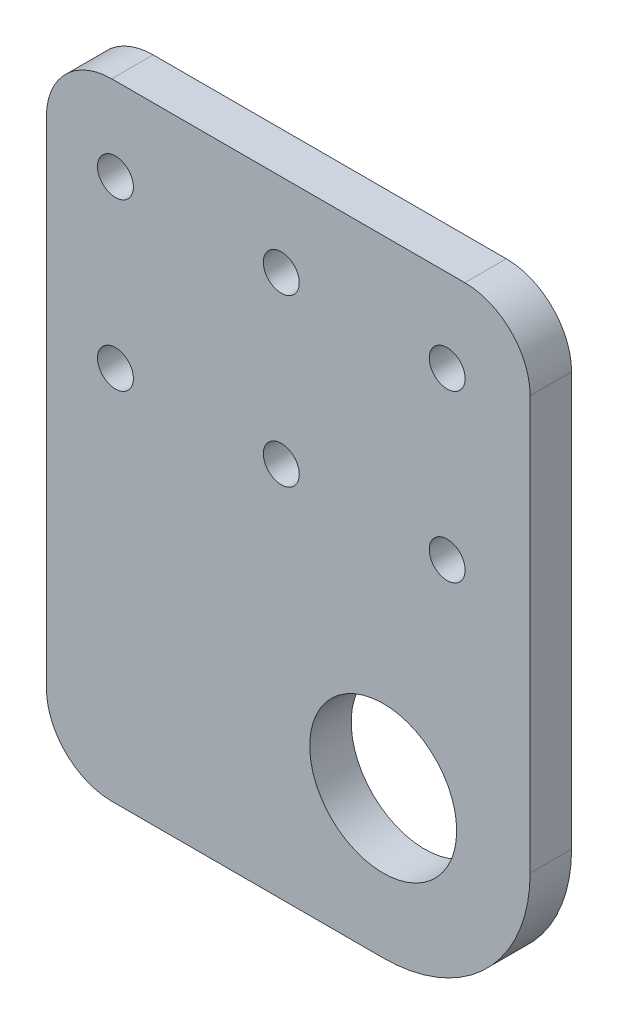
ISO-10303-21;
HEADER;
FILE_DESCRIPTION(('STEP AP214'),'2;1');
FILE_NAME('part.step','',(''),(''),'','','');
FILE_SCHEMA(('AUTOMOTIVE_DESIGN { 1 0 10303 214 1 1 1 1 }'));
ENDSEC;
DATA;
#1=APPLICATION_CONTEXT('core data for automotive mechanical design processes');
#2=APPLICATION_PROTOCOL_DEFINITION('international standard','automotive_design',2000,#1);
#3=PRODUCT_CONTEXT('',#1,'mechanical');
#4=PRODUCT('Part','Part','',(#3));
#5=PRODUCT_RELATED_PRODUCT_CATEGORY('part','',(#4));
#6=PRODUCT_DEFINITION_FORMATION('','',#4);
#7=PRODUCT_DEFINITION_CONTEXT('part definition',#1,'design');
#8=PRODUCT_DEFINITION('design','',#6,#7);
#9=PRODUCT_DEFINITION_SHAPE('','',#8);
#10=(LENGTH_UNIT() NAMED_UNIT(*) SI_UNIT(.MILLI.,.METRE.));
#11=(NAMED_UNIT(*) PLANE_ANGLE_UNIT() SI_UNIT($,.RADIAN.));
#12=(NAMED_UNIT(*) SI_UNIT($,.STERADIAN.) SOLID_ANGLE_UNIT());
#13=UNCERTAINTY_MEASURE_WITH_UNIT(LENGTH_MEASURE(1.E-05),#10,'distance_accuracy_value','');
#14=(GEOMETRIC_REPRESENTATION_CONTEXT(3) GLOBAL_UNCERTAINTY_ASSIGNED_CONTEXT((#13)) GLOBAL_UNIT_ASSIGNED_CONTEXT((#10,
#11,#12)) REPRESENTATION_CONTEXT('',''));
#15=CARTESIAN_POINT('',(0.,0.,0.));
#16=DIRECTION('',(0.,0.,1.));
#17=DIRECTION('',(1.,0.,0.));
#18=AXIS2_PLACEMENT_3D('',#15,#16,#17);
#19=CARTESIAN_POINT('',(-37.035,-25.4,6.35));
#20=DIRECTION('',(1.,0.,0.));
#21=DIRECTION('',(0.,1.,0.));
#22=AXIS2_PLACEMENT_3D('',#19,#20,#21);
#23=PLANE('',#22);
#24=DIRECTION('',(0.,-1.,0.));
#25=VECTOR('',#24,1.);
#26=CARTESIAN_POINT('',(-37.035,-25.4,0.));
#27=LINE('',#26,#25);
#28=CARTESIAN_POINT('',(-37.035,15.4,0.));
#29=VERTEX_POINT('',#28);
#30=CARTESIAN_POINT('',(-37.035,-60.4,0.));
#31=VERTEX_POINT('',#30);
#32=EDGE_CURVE('E115',#29,#31,#27,.T.);
#33=ORIENTED_EDGE('',*,*,#32,.T.);
#34=DIRECTION('',(0.,0.,1.));
#35=VECTOR('',#34,1.);
#36=CARTESIAN_POINT('',(-37.035,-60.4,6.35));
#37=LINE('',#36,#35);
#38=CARTESIAN_POINT('',(-37.035,-60.4,6.35));
#39=VERTEX_POINT('',#38);
#40=EDGE_CURVE('E150',#31,#39,#37,.T.);
#41=ORIENTED_EDGE('',*,*,#40,.T.);
#42=DIRECTION('',(0.,-1.,0.));
#43=VECTOR('',#42,1.);
#44=CARTESIAN_POINT('',(-37.035,-25.4,6.35));
#45=LINE('',#44,#43);
#46=CARTESIAN_POINT('',(-37.035,15.4,6.35));
#47=VERTEX_POINT('',#46);
#48=EDGE_CURVE('E118',#47,#39,#45,.T.);
#49=ORIENTED_EDGE('',*,*,#48,.F.);
#50=DIRECTION('',(0.,0.,-1.));
#51=VECTOR('',#50,1.);
#52=CARTESIAN_POINT('',(-37.035,15.4,6.35));
#53=LINE('',#52,#51);
#54=EDGE_CURVE('E102',#47,#29,#53,.T.);
#55=ORIENTED_EDGE('',*,*,#54,.T.);
#56=EDGE_LOOP('',(#33,#41,#49,#55));
#57=FACE_BOUND('',#56,.T.);
#58=ADVANCED_FACE('F35',(#57),#23,.F.);
#59=CARTESIAN_POINT('',(37.035,-25.4,6.35));
#60=DIRECTION('',(-1.,0.,0.));
#61=DIRECTION('',(0.,-1.,0.));
#62=AXIS2_PLACEMENT_3D('',#59,#60,#61);
#63=PLANE('',#62);
#64=DIRECTION('',(0.,1.,0.));
#65=VECTOR('',#64,1.);
#66=CARTESIAN_POINT('',(37.035,-25.4,6.35));
#67=LINE('',#66,#65);
#68=CARTESIAN_POINT('',(37.035,-47.9,6.35));
#69=VERTEX_POINT('',#68);
#70=CARTESIAN_POINT('',(37.035,15.4,6.35));
#71=VERTEX_POINT('',#70);
#72=EDGE_CURVE('E212',#69,#71,#67,.T.);
#73=ORIENTED_EDGE('',*,*,#72,.F.);
#74=DIRECTION('',(0.,0.,1.));
#75=VECTOR('',#74,1.);
#76=CARTESIAN_POINT('',(37.035,-47.9,0.));
#77=LINE('',#76,#75);
#78=CARTESIAN_POINT('',(37.035,-47.9,0.));
#79=VERTEX_POINT('',#78);
#80=EDGE_CURVE('E43',#69,#79,#77,.F.);
#81=ORIENTED_EDGE('',*,*,#80,.T.);
#82=DIRECTION('',(0.,1.,0.));
#83=VECTOR('',#82,1.);
#84=CARTESIAN_POINT('',(37.035,-25.4,0.));
#85=LINE('',#84,#83);
#86=CARTESIAN_POINT('',(37.035,15.4,0.));
#87=VERTEX_POINT('',#86);
#88=EDGE_CURVE('E126',#79,#87,#85,.T.);
#89=ORIENTED_EDGE('',*,*,#88,.T.);
#90=DIRECTION('',(0.,0.,-1.));
#91=VECTOR('',#90,1.);
#92=CARTESIAN_POINT('',(37.035,15.4,6.35));
#93=LINE('',#92,#91);
#94=EDGE_CURVE('E143',#87,#71,#93,.F.);
#95=ORIENTED_EDGE('',*,*,#94,.T.);
#96=EDGE_LOOP('',(#73,#81,#89,#95));
#97=FACE_BOUND('',#96,.T.);
#98=ADVANCED_FACE('F230',(#97),#63,.F.);
#99=CARTESIAN_POINT('',(37.035,25.4,6.35));
#100=DIRECTION('',(0.,-1.,0.));
#101=DIRECTION('',(1.,0.,0.));
#102=AXIS2_PLACEMENT_3D('',#99,#100,#101);
#103=PLANE('',#102);
#104=DIRECTION('',(-1.,0.,0.));
#105=VECTOR('',#104,1.);
#106=CARTESIAN_POINT('',(37.035,25.4,6.35));
#107=LINE('',#106,#105);
#108=CARTESIAN_POINT('',(27.035,25.4,6.35));
#109=VERTEX_POINT('',#108);
#110=CARTESIAN_POINT('',(-27.035,25.4,6.35));
#111=VERTEX_POINT('',#110);
#112=EDGE_CURVE('E109',#109,#111,#107,.T.);
#113=ORIENTED_EDGE('',*,*,#112,.F.);
#114=DIRECTION('',(0.,0.,-1.));
#115=VECTOR('',#114,1.);
#116=CARTESIAN_POINT('',(27.035,25.4,6.35));
#117=LINE('',#116,#115);
#118=CARTESIAN_POINT('',(27.035,25.4,0.));
#119=VERTEX_POINT('',#118);
#120=EDGE_CURVE('E147',#109,#119,#117,.T.);
#121=ORIENTED_EDGE('',*,*,#120,.T.);
#122=DIRECTION('',(-1.,0.,0.));
#123=VECTOR('',#122,1.);
#124=CARTESIAN_POINT('',(37.035,25.4,0.));
#125=LINE('',#124,#123);
#126=CARTESIAN_POINT('',(-27.035,25.4,0.));
#127=VERTEX_POINT('',#126);
#128=EDGE_CURVE('E129',#119,#127,#125,.T.);
#129=ORIENTED_EDGE('',*,*,#128,.T.);
#130=DIRECTION('',(0.,0.,-1.));
#131=VECTOR('',#130,1.);
#132=CARTESIAN_POINT('',(-27.035,25.4,6.35));
#133=LINE('',#132,#131);
#134=EDGE_CURVE('E103',#127,#111,#133,.F.);
#135=ORIENTED_EDGE('',*,*,#134,.T.);
#136=EDGE_LOOP('',(#113,#121,#129,#135));
#137=FACE_BOUND('',#136,.T.);
#138=ADVANCED_FACE('F218',(#137),#103,.F.);
#139=CARTESIAN_POINT('',(0.,0.,6.35));
#140=DIRECTION('',(0.,0.,1.));
#141=DIRECTION('',(1.,0.,0.));
#142=AXIS2_PLACEMENT_3D('',#139,#140,#141);
#143=PLANE('',#142);
#144=CARTESIAN_POINT('',(14.535,-47.9,6.35));
#145=DIRECTION('',(0.,0.,1.));
#146=DIRECTION('',(1.,0.,0.));
#147=AXIS2_PLACEMENT_3D('',#144,#145,#146);
#148=CIRCLE('',#147,11.25);
#149=CARTESIAN_POINT('',(25.785,-47.9,6.35));
#150=VERTEX_POINT('',#149);
#151=EDGE_CURVE('E177',#150,#150,#148,.T.);
#152=ORIENTED_EDGE('',*,*,#151,.F.);
#153=EDGE_LOOP('',(#152));
#154=FACE_BOUND('',#153,.T.);
#155=DIRECTION('',(1.,0.,0.));
#156=VECTOR('',#155,1.);
#157=CARTESIAN_POINT('',(37.035,-70.4,6.35));
#158=LINE('',#157,#156);
#159=CARTESIAN_POINT('',(-27.035,-70.4,6.35));
#160=VERTEX_POINT('',#159);
#161=CARTESIAN_POINT('',(14.535,-70.4,6.35));
#162=VERTEX_POINT('',#161);
#163=EDGE_CURVE('E165',#160,#162,#158,.T.);
#164=ORIENTED_EDGE('',*,*,#163,.T.);
#165=CARTESIAN_POINT('',(14.535,-47.9,6.35));
#166=DIRECTION('',(0.,0.,1.));
#167=DIRECTION('',(1.,0.,0.));
#168=AXIS2_PLACEMENT_3D('',#165,#166,#167);
#169=CIRCLE('',#168,22.5);
#170=EDGE_CURVE('E57',#162,#69,#169,.T.);
#171=ORIENTED_EDGE('',*,*,#170,.T.);
#172=ORIENTED_EDGE('',*,*,#72,.T.);
#173=CARTESIAN_POINT('',(27.035,15.4,6.35));
#174=DIRECTION('',(0.,0.,1.));
#175=DIRECTION('',(1.,0.,0.));
#176=AXIS2_PLACEMENT_3D('',#173,#174,#175);
#177=CIRCLE('',#176,10.);
#178=EDGE_CURVE('E141',#71,#109,#177,.T.);
#179=ORIENTED_EDGE('',*,*,#178,.T.);
#180=ORIENTED_EDGE('',*,*,#112,.T.);
#181=CARTESIAN_POINT('',(-27.035,15.4,6.35));
#182=DIRECTION('',(0.,0.,1.));
#183=DIRECTION('',(1.,0.,0.));
#184=AXIS2_PLACEMENT_3D('',#181,#182,#183);
#185=CIRCLE('',#184,10.);
#186=EDGE_CURVE('E119',#111,#47,#185,.T.);
#187=ORIENTED_EDGE('',*,*,#186,.T.);
#188=ORIENTED_EDGE('',*,*,#48,.T.);
#189=CARTESIAN_POINT('',(-27.035,-60.4,6.35));
#190=DIRECTION('',(0.,0.,1.));
#191=DIRECTION('',(1.,0.,0.));
#192=AXIS2_PLACEMENT_3D('',#189,#190,#191);
#193=CIRCLE('',#192,10.);
#194=EDGE_CURVE('E152',#39,#160,#193,.T.);
#195=ORIENTED_EDGE('',*,*,#194,.T.);
#196=EDGE_LOOP('',(#164,#171,#172,#179,#180,#187,#188,#195));
#197=FACE_BOUND('',#196,.T.);
#198=CARTESIAN_POINT('',(-26.465,12.7,6.35));
#199=DIRECTION('',(0.,0.,1.));
#200=DIRECTION('',(1.,0.,0.));
#201=AXIS2_PLACEMENT_3D('',#198,#199,#200);
#202=CIRCLE('',#201,2.74999999999999);
#203=CARTESIAN_POINT('',(-23.715,12.7,6.35));
#204=VERTEX_POINT('',#203);
#205=EDGE_CURVE('E174',#204,#204,#202,.T.);
#206=ORIENTED_EDGE('',*,*,#205,.F.);
#207=EDGE_LOOP('',(#206));
#208=FACE_BOUND('',#207,.T.);
#209=CARTESIAN_POINT('',(-26.465,-12.7,6.35));
#210=DIRECTION('',(0.,0.,1.));
#211=DIRECTION('',(1.,0.,0.));
#212=AXIS2_PLACEMENT_3D('',#209,#210,#211);
#213=CIRCLE('',#212,2.74999999999999);
#214=CARTESIAN_POINT('',(-23.715,-12.7,6.35));
#215=VERTEX_POINT('',#214);
#216=EDGE_CURVE('E186',#215,#215,#213,.T.);
#217=ORIENTED_EDGE('',*,*,#216,.F.);
#218=EDGE_LOOP('',(#217));
#219=FACE_BOUND('',#218,.T.);
#220=CARTESIAN_POINT('',(-1.06499999999997,-12.7,6.35));
#221=DIRECTION('',(0.,0.,1.));
#222=DIRECTION('',(1.,0.,0.));
#223=AXIS2_PLACEMENT_3D('',#220,#221,#222);
#224=CIRCLE('',#223,2.74999999999999);
#225=CARTESIAN_POINT('',(1.68500000000001,-12.7,6.35));
#226=VERTEX_POINT('',#225);
#227=EDGE_CURVE('E192',#226,#226,#224,.T.);
#228=ORIENTED_EDGE('',*,*,#227,.F.);
#229=EDGE_LOOP('',(#228));
#230=FACE_BOUND('',#229,.T.);
#231=CARTESIAN_POINT('',(-1.06499999999998,12.7,6.35));
#232=DIRECTION('',(0.,0.,1.));
#233=DIRECTION('',(1.,0.,0.));
#234=AXIS2_PLACEMENT_3D('',#231,#232,#233);
#235=CIRCLE('',#234,2.74999999999999);
#236=CARTESIAN_POINT('',(1.68500000000001,12.7,6.35));
#237=VERTEX_POINT('',#236);
#238=EDGE_CURVE('E198',#237,#237,#235,.T.);
#239=ORIENTED_EDGE('',*,*,#238,.F.);
#240=EDGE_LOOP('',(#239));
#241=FACE_BOUND('',#240,.T.);
#242=CARTESIAN_POINT('',(24.335,12.7,6.35));
#243=DIRECTION('',(0.,0.,1.));
#244=DIRECTION('',(1.,0.,0.));
#245=AXIS2_PLACEMENT_3D('',#242,#243,#244);
#246=CIRCLE('',#245,2.74999999999999);
#247=CARTESIAN_POINT('',(27.085,12.7,6.35));
#248=VERTEX_POINT('',#247);
#249=EDGE_CURVE('E204',#248,#248,#246,.T.);
#250=ORIENTED_EDGE('',*,*,#249,.F.);
#251=EDGE_LOOP('',(#250));
#252=FACE_BOUND('',#251,.T.);
#253=CARTESIAN_POINT('',(24.335,-12.7,6.35));
#254=DIRECTION('',(0.,0.,1.));
#255=DIRECTION('',(1.,0.,0.));
#256=AXIS2_PLACEMENT_3D('',#253,#254,#255);
#257=CIRCLE('',#256,2.74999999999999);
#258=CARTESIAN_POINT('',(27.085,-12.7,6.35));
#259=VERTEX_POINT('',#258);
#260=EDGE_CURVE('E132',#259,#259,#257,.T.);
#261=ORIENTED_EDGE('',*,*,#260,.F.);
#262=EDGE_LOOP('',(#261));
#263=FACE_BOUND('',#262,.T.);
#264=ADVANCED_FACE('F170',(#154,#197,#208,#219,#230,#241,#252,#263),#143,.T.);
#265=CARTESIAN_POINT('',(0.,0.,0.));
#266=DIRECTION('',(0.,0.,1.));
#267=DIRECTION('',(1.,0.,0.));
#268=AXIS2_PLACEMENT_3D('',#265,#266,#267);
#269=PLANE('',#268);
#270=CARTESIAN_POINT('',(14.535,-47.9,0.));
#271=DIRECTION('',(0.,0.,1.));
#272=DIRECTION('',(1.,0.,0.));
#273=AXIS2_PLACEMENT_3D('',#270,#271,#272);
#274=CIRCLE('',#273,11.25);
#275=CARTESIAN_POINT('',(25.785,-47.9,0.));
#276=VERTEX_POINT('',#275);
#277=EDGE_CURVE('E172',#276,#276,#274,.T.);
#278=ORIENTED_EDGE('',*,*,#277,.T.);
#279=EDGE_LOOP('',(#278));
#280=FACE_BOUND('',#279,.T.);
#281=ORIENTED_EDGE('',*,*,#88,.F.);
#282=CARTESIAN_POINT('',(14.535,-47.9,0.));
#283=DIRECTION('',(0.,0.,1.));
#284=DIRECTION('',(1.,0.,0.));
#285=AXIS2_PLACEMENT_3D('',#282,#283,#284);
#286=CIRCLE('',#285,22.5);
#287=CARTESIAN_POINT('',(14.535,-70.4,0.));
#288=VERTEX_POINT('',#287);
#289=EDGE_CURVE('E11',#79,#288,#286,.F.);
#290=ORIENTED_EDGE('',*,*,#289,.T.);
#291=DIRECTION('',(1.,0.,0.));
#292=VECTOR('',#291,1.);
#293=CARTESIAN_POINT('',(37.035,-70.4,0.));
#294=LINE('',#293,#292);
#295=CARTESIAN_POINT('',(-27.035,-70.4,0.));
#296=VERTEX_POINT('',#295);
#297=EDGE_CURVE('E167',#296,#288,#294,.T.);
#298=ORIENTED_EDGE('',*,*,#297,.F.);
#299=CARTESIAN_POINT('',(-27.035,-60.4,0.));
#300=DIRECTION('',(0.,0.,1.));
#301=DIRECTION('',(1.,0.,0.));
#302=AXIS2_PLACEMENT_3D('',#299,#300,#301);
#303=CIRCLE('',#302,10.);
#304=EDGE_CURVE('E125',#296,#31,#303,.F.);
#305=ORIENTED_EDGE('',*,*,#304,.T.);
#306=ORIENTED_EDGE('',*,*,#32,.F.);
#307=CARTESIAN_POINT('',(-27.035,15.4,0.));
#308=DIRECTION('',(0.,0.,1.));
#309=DIRECTION('',(1.,0.,0.));
#310=AXIS2_PLACEMENT_3D('',#307,#308,#309);
#311=CIRCLE('',#310,10.);
#312=EDGE_CURVE('E98',#29,#127,#311,.F.);
#313=ORIENTED_EDGE('',*,*,#312,.T.);
#314=ORIENTED_EDGE('',*,*,#128,.F.);
#315=CARTESIAN_POINT('',(27.035,15.4,0.));
#316=DIRECTION('',(0.,0.,1.));
#317=DIRECTION('',(1.,0.,0.));
#318=AXIS2_PLACEMENT_3D('',#315,#316,#317);
#319=CIRCLE('',#318,10.);
#320=EDGE_CURVE('E108',#119,#87,#319,.F.);
#321=ORIENTED_EDGE('',*,*,#320,.T.);
#322=EDGE_LOOP('',(#281,#290,#298,#305,#306,#313,#314,#321));
#323=FACE_BOUND('',#322,.T.);
#324=CARTESIAN_POINT('',(-26.465,12.7,0.));
#325=DIRECTION('',(0.,0.,1.));
#326=DIRECTION('',(1.,0.,0.));
#327=AXIS2_PLACEMENT_3D('',#324,#325,#326);
#328=CIRCLE('',#327,2.75);
#329=CARTESIAN_POINT('',(-23.715,12.7,0.));
#330=VERTEX_POINT('',#329);
#331=EDGE_CURVE('E183',#330,#330,#328,.T.);
#332=ORIENTED_EDGE('',*,*,#331,.T.);
#333=EDGE_LOOP('',(#332));
#334=FACE_BOUND('',#333,.T.);
#335=CARTESIAN_POINT('',(-26.465,-12.7,0.));
#336=DIRECTION('',(0.,0.,1.));
#337=DIRECTION('',(1.,0.,0.));
#338=AXIS2_PLACEMENT_3D('',#335,#336,#337);
#339=CIRCLE('',#338,2.75);
#340=CARTESIAN_POINT('',(-23.715,-12.7,0.));
#341=VERTEX_POINT('',#340);
#342=EDGE_CURVE('E189',#341,#341,#339,.T.);
#343=ORIENTED_EDGE('',*,*,#342,.T.);
#344=EDGE_LOOP('',(#343));
#345=FACE_BOUND('',#344,.T.);
#346=CARTESIAN_POINT('',(-1.06499999999997,-12.7,0.));
#347=DIRECTION('',(0.,0.,1.));
#348=DIRECTION('',(1.,0.,0.));
#349=AXIS2_PLACEMENT_3D('',#346,#347,#348);
#350=CIRCLE('',#349,2.75);
#351=CARTESIAN_POINT('',(1.68500000000002,-12.7,0.));
#352=VERTEX_POINT('',#351);
#353=EDGE_CURVE('E195',#352,#352,#350,.T.);
#354=ORIENTED_EDGE('',*,*,#353,.T.);
#355=EDGE_LOOP('',(#354));
#356=FACE_BOUND('',#355,.T.);
#357=CARTESIAN_POINT('',(-1.06499999999998,12.7,0.));
#358=DIRECTION('',(0.,0.,1.));
#359=DIRECTION('',(1.,0.,0.));
#360=AXIS2_PLACEMENT_3D('',#357,#358,#359);
#361=CIRCLE('',#360,2.75);
#362=CARTESIAN_POINT('',(1.68500000000002,12.7,0.));
#363=VERTEX_POINT('',#362);
#364=EDGE_CURVE('E201',#363,#363,#361,.T.);
#365=ORIENTED_EDGE('',*,*,#364,.T.);
#366=EDGE_LOOP('',(#365));
#367=FACE_BOUND('',#366,.T.);
#368=CARTESIAN_POINT('',(24.335,12.7,0.));
#369=DIRECTION('',(0.,0.,1.));
#370=DIRECTION('',(1.,0.,0.));
#371=AXIS2_PLACEMENT_3D('',#368,#369,#370);
#372=CIRCLE('',#371,2.75);
#373=CARTESIAN_POINT('',(27.085,12.7,0.));
#374=VERTEX_POINT('',#373);
#375=EDGE_CURVE('E207',#374,#374,#372,.T.);
#376=ORIENTED_EDGE('',*,*,#375,.T.);
#377=EDGE_LOOP('',(#376));
#378=FACE_BOUND('',#377,.T.);
#379=CARTESIAN_POINT('',(24.335,-12.7,0.));
#380=DIRECTION('',(0.,0.,1.));
#381=DIRECTION('',(1.,0.,0.));
#382=AXIS2_PLACEMENT_3D('',#379,#380,#381);
#383=CIRCLE('',#382,2.75);
#384=CARTESIAN_POINT('',(27.085,-12.7,0.));
#385=VERTEX_POINT('',#384);
#386=EDGE_CURVE('E127',#385,#385,#383,.T.);
#387=ORIENTED_EDGE('',*,*,#386,.T.);
#388=EDGE_LOOP('',(#387));
#389=FACE_BOUND('',#388,.T.);
#390=ADVANCED_FACE('F121',(#280,#323,#334,#345,#356,#367,#378,#389),#269,.F.);
#391=CARTESIAN_POINT('',(27.035,15.4,6.35));
#392=DIRECTION('',(0.,0.,-1.));
#393=DIRECTION('',(-1.,0.,0.));
#394=AXIS2_PLACEMENT_3D('',#391,#392,#393);
#395=CYLINDRICAL_SURFACE('',#394,10.);
#396=ORIENTED_EDGE('',*,*,#178,.F.);
#397=ORIENTED_EDGE('',*,*,#94,.F.);
#398=ORIENTED_EDGE('',*,*,#320,.F.);
#399=ORIENTED_EDGE('',*,*,#120,.F.);
#400=EDGE_LOOP('',(#396,#397,#398,#399));
#401=FACE_BOUND('',#400,.T.);
#402=ADVANCED_FACE('F220',(#401),#395,.T.);
#403=CARTESIAN_POINT('',(-27.035,15.4,6.35));
#404=DIRECTION('',(0.,0.,-1.));
#405=DIRECTION('',(-1.,0.,0.));
#406=AXIS2_PLACEMENT_3D('',#403,#404,#405);
#407=CYLINDRICAL_SURFACE('',#406,10.);
#408=ORIENTED_EDGE('',*,*,#186,.F.);
#409=ORIENTED_EDGE('',*,*,#134,.F.);
#410=ORIENTED_EDGE('',*,*,#312,.F.);
#411=ORIENTED_EDGE('',*,*,#54,.F.);
#412=EDGE_LOOP('',(#408,#409,#410,#411));
#413=FACE_BOUND('',#412,.T.);
#414=ADVANCED_FACE('F101',(#413),#407,.T.);
#415=CARTESIAN_POINT('',(24.335,-12.7,6.35));
#416=DIRECTION('',(0.,0.,1.));
#417=DIRECTION('',(1.,0.,0.));
#418=AXIS2_PLACEMENT_3D('',#415,#416,#417);
#419=CYLINDRICAL_SURFACE('',#418,2.74999999999999);
#420=ORIENTED_EDGE('',*,*,#386,.F.);
#421=EDGE_LOOP('',(#420));
#422=FACE_BOUND('',#421,.T.);
#423=ORIENTED_EDGE('',*,*,#260,.T.);
#424=EDGE_LOOP('',(#423));
#425=FACE_BOUND('',#424,.T.);
#426=ADVANCED_FACE('F242',(#422,#425),#419,.F.);
#427=CARTESIAN_POINT('',(24.335,12.7,6.35));
#428=DIRECTION('',(0.,0.,1.));
#429=DIRECTION('',(1.,0.,0.));
#430=AXIS2_PLACEMENT_3D('',#427,#428,#429);
#431=CYLINDRICAL_SURFACE('',#430,2.74999999999999);
#432=ORIENTED_EDGE('',*,*,#375,.F.);
#433=EDGE_LOOP('',(#432));
#434=FACE_BOUND('',#433,.T.);
#435=ORIENTED_EDGE('',*,*,#249,.T.);
#436=EDGE_LOOP('',(#435));
#437=FACE_BOUND('',#436,.T.);
#438=ADVANCED_FACE('F246',(#434,#437),#431,.F.);
#439=CARTESIAN_POINT('',(-1.06499999999998,12.7,6.35));
#440=DIRECTION('',(0.,0.,1.));
#441=DIRECTION('',(1.,0.,0.));
#442=AXIS2_PLACEMENT_3D('',#439,#440,#441);
#443=CYLINDRICAL_SURFACE('',#442,2.74999999999999);
#444=ORIENTED_EDGE('',*,*,#364,.F.);
#445=EDGE_LOOP('',(#444));
#446=FACE_BOUND('',#445,.T.);
#447=ORIENTED_EDGE('',*,*,#238,.T.);
#448=EDGE_LOOP('',(#447));
#449=FACE_BOUND('',#448,.T.);
#450=ADVANCED_FACE('F252',(#446,#449),#443,.F.);
#451=CARTESIAN_POINT('',(-1.06499999999997,-12.7,6.35));
#452=DIRECTION('',(0.,0.,1.));
#453=DIRECTION('',(1.,0.,0.));
#454=AXIS2_PLACEMENT_3D('',#451,#452,#453);
#455=CYLINDRICAL_SURFACE('',#454,2.74999999999999);
#456=ORIENTED_EDGE('',*,*,#353,.F.);
#457=EDGE_LOOP('',(#456));
#458=FACE_BOUND('',#457,.T.);
#459=ORIENTED_EDGE('',*,*,#227,.T.);
#460=EDGE_LOOP('',(#459));
#461=FACE_BOUND('',#460,.T.);
#462=ADVANCED_FACE('F295',(#458,#461),#455,.F.);
#463=CARTESIAN_POINT('',(-26.465,-12.7,6.35));
#464=DIRECTION('',(0.,0.,1.));
#465=DIRECTION('',(1.,0.,0.));
#466=AXIS2_PLACEMENT_3D('',#463,#464,#465);
#467=CYLINDRICAL_SURFACE('',#466,2.74999999999999);
#468=ORIENTED_EDGE('',*,*,#342,.F.);
#469=EDGE_LOOP('',(#468));
#470=FACE_BOUND('',#469,.T.);
#471=ORIENTED_EDGE('',*,*,#216,.T.);
#472=EDGE_LOOP('',(#471));
#473=FACE_BOUND('',#472,.T.);
#474=ADVANCED_FACE('F304',(#470,#473),#467,.F.);
#475=CARTESIAN_POINT('',(-26.465,12.7,6.35));
#476=DIRECTION('',(0.,0.,1.));
#477=DIRECTION('',(1.,0.,0.));
#478=AXIS2_PLACEMENT_3D('',#475,#476,#477);
#479=CYLINDRICAL_SURFACE('',#478,2.74999999999999);
#480=ORIENTED_EDGE('',*,*,#331,.F.);
#481=EDGE_LOOP('',(#480));
#482=FACE_BOUND('',#481,.T.);
#483=ORIENTED_EDGE('',*,*,#205,.T.);
#484=EDGE_LOOP('',(#483));
#485=FACE_BOUND('',#484,.T.);
#486=ADVANCED_FACE('F314',(#482,#485),#479,.F.);
#487=CARTESIAN_POINT('',(37.035,-70.4,0.));
#488=DIRECTION('',(0.,-1.,0.));
#489=DIRECTION('',(1.,0.,0.));
#490=AXIS2_PLACEMENT_3D('',#487,#488,#489);
#491=PLANE('',#490);
#492=ORIENTED_EDGE('',*,*,#297,.T.);
#493=DIRECTION('',(0.,0.,1.));
#494=VECTOR('',#493,1.);
#495=CARTESIAN_POINT('',(14.535,-70.4,6.35));
#496=LINE('',#495,#494);
#497=EDGE_CURVE('E157',#288,#162,#496,.T.);
#498=ORIENTED_EDGE('',*,*,#497,.T.);
#499=ORIENTED_EDGE('',*,*,#163,.F.);
#500=DIRECTION('',(0.,0.,1.));
#501=VECTOR('',#500,1.);
#502=CARTESIAN_POINT('',(-27.035,-70.4,0.));
#503=LINE('',#502,#501);
#504=EDGE_CURVE('E154',#160,#296,#503,.F.);
#505=ORIENTED_EDGE('',*,*,#504,.T.);
#506=EDGE_LOOP('',(#492,#498,#499,#505));
#507=FACE_BOUND('',#506,.T.);
#508=ADVANCED_FACE('F164',(#507),#491,.T.);
#509=CARTESIAN_POINT('',(14.535,-47.9,0.));
#510=DIRECTION('',(0.,0.,1.));
#511=DIRECTION('',(1.,0.,0.));
#512=AXIS2_PLACEMENT_3D('',#509,#510,#511);
#513=CYLINDRICAL_SURFACE('',#512,11.25);
#514=ORIENTED_EDGE('',*,*,#277,.F.);
#515=EDGE_LOOP('',(#514));
#516=FACE_BOUND('',#515,.T.);
#517=ORIENTED_EDGE('',*,*,#151,.T.);
#518=EDGE_LOOP('',(#517));
#519=FACE_BOUND('',#518,.T.);
#520=ADVANCED_FACE('F227',(#516,#519),#513,.F.);
#521=CARTESIAN_POINT('',(-27.035,-60.4,6.35));
#522=DIRECTION('',(0.,0.,-1.));
#523=DIRECTION('',(-1.,0.,0.));
#524=AXIS2_PLACEMENT_3D('',#521,#522,#523);
#525=CYLINDRICAL_SURFACE('',#524,10.);
#526=ORIENTED_EDGE('',*,*,#304,.F.);
#527=ORIENTED_EDGE('',*,*,#504,.F.);
#528=ORIENTED_EDGE('',*,*,#194,.F.);
#529=ORIENTED_EDGE('',*,*,#40,.F.);
#530=EDGE_LOOP('',(#526,#527,#528,#529));
#531=FACE_BOUND('',#530,.T.);
#532=ADVANCED_FACE('F223',(#531),#525,.T.);
#533=CARTESIAN_POINT('',(14.535,-47.9,0.));
#534=DIRECTION('',(0.,0.,-1.));
#535=DIRECTION('',(-1.,0.,0.));
#536=AXIS2_PLACEMENT_3D('',#533,#534,#535);
#537=CYLINDRICAL_SURFACE('',#536,22.5);
#538=ORIENTED_EDGE('',*,*,#289,.F.);
#539=ORIENTED_EDGE('',*,*,#80,.F.);
#540=ORIENTED_EDGE('',*,*,#170,.F.);
#541=ORIENTED_EDGE('',*,*,#497,.F.);
#542=EDGE_LOOP('',(#538,#539,#540,#541));
#543=FACE_BOUND('',#542,.T.);
#544=ADVANCED_FACE('F37',(#543),#537,.T.);
#545=CLOSED_SHELL('',(#58,#98,#138,#264,#390,#402,#414,#426,#438,#450,#462,#474,#486,#508,#520,
#532,#544));
#546=MANIFOLD_SOLID_BREP('B2',#545);
#547=ADVANCED_BREP_SHAPE_REPRESENTATION('',(#18,#546),#14);
#548=SHAPE_DEFINITION_REPRESENTATION(#9,#547);
ENDSEC;
END-ISO-10303-21;
